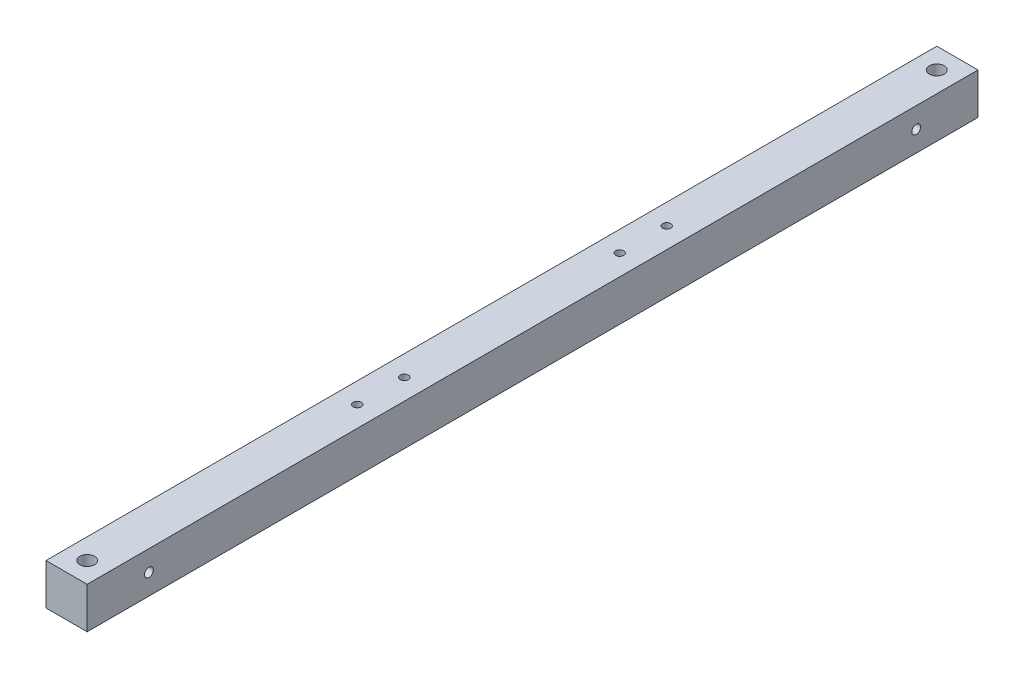
ISO-10303-21;
HEADER;
FILE_DESCRIPTION(('STEP AP214'),'2;1');
FILE_NAME('part.step','',(''),(''),'','','');
FILE_SCHEMA(('AUTOMOTIVE_DESIGN { 1 0 10303 214 1 1 1 1 }'));
ENDSEC;
DATA;
#1=APPLICATION_CONTEXT('core data for automotive mechanical design processes');
#2=APPLICATION_PROTOCOL_DEFINITION('international standard','automotive_design',2000,#1);
#3=PRODUCT_CONTEXT('',#1,'mechanical');
#4=PRODUCT('Part','Part','',(#3));
#5=PRODUCT_RELATED_PRODUCT_CATEGORY('part','',(#4));
#6=PRODUCT_DEFINITION_FORMATION('','',#4);
#7=PRODUCT_DEFINITION_CONTEXT('part definition',#1,'design');
#8=PRODUCT_DEFINITION('design','',#6,#7);
#9=PRODUCT_DEFINITION_SHAPE('','',#8);
#10=(LENGTH_UNIT() NAMED_UNIT(*) SI_UNIT(.MILLI.,.METRE.));
#11=(NAMED_UNIT(*) PLANE_ANGLE_UNIT() SI_UNIT($,.RADIAN.));
#12=(NAMED_UNIT(*) SI_UNIT($,.STERADIAN.) SOLID_ANGLE_UNIT());
#13=UNCERTAINTY_MEASURE_WITH_UNIT(LENGTH_MEASURE(1.E-05),#10,'distance_accuracy_value','');
#14=(GEOMETRIC_REPRESENTATION_CONTEXT(3) GLOBAL_UNCERTAINTY_ASSIGNED_CONTEXT((#13)) GLOBAL_UNIT_ASSIGNED_CONTEXT((#10,
#11,#12)) REPRESENTATION_CONTEXT('',''));
#15=CARTESIAN_POINT('',(0.,0.,0.));
#16=DIRECTION('',(0.,0.,1.));
#17=DIRECTION('',(1.,0.,0.));
#18=AXIS2_PLACEMENT_3D('',#15,#16,#17);
#19=CARTESIAN_POINT('',(0.,-14.,14.));
#20=DIRECTION('',(0.,1.,0.));
#21=DIRECTION('',(0.,0.,1.));
#22=AXIS2_PLACEMENT_3D('',#19,#20,#21);
#23=CYLINDRICAL_SURFACE('',#22,3.);
#24=CARTESIAN_POINT('',(0.,-14.,14.));
#25=DIRECTION('',(0.,1.,0.));
#26=DIRECTION('',(0.,0.,1.));
#27=AXIS2_PLACEMENT_3D('',#24,#25,#26);
#28=CIRCLE('',#27,3.);
#29=CARTESIAN_POINT('',(0.,-14.,17.));
#30=VERTEX_POINT('',#29);
#31=EDGE_CURVE('E121',#30,#30,#28,.T.);
#32=ORIENTED_EDGE('',*,*,#31,.F.);
#33=EDGE_LOOP('',(#32));
#34=FACE_BOUND('',#33,.T.);
#35=CARTESIAN_POINT('',(0.,7.,14.));
#36=DIRECTION('',(0.,1.,0.));
#37=DIRECTION('',(0.,0.,1.));
#38=AXIS2_PLACEMENT_3D('',#35,#36,#37);
#39=CIRCLE('',#38,3.);
#40=CARTESIAN_POINT('',(0.,7.,17.));
#41=VERTEX_POINT('',#40);
#42=EDGE_CURVE('E36',#41,#41,#39,.F.);
#43=ORIENTED_EDGE('',*,*,#42,.F.);
#44=EDGE_LOOP('',(#43));
#45=FACE_BOUND('',#44,.T.);
#46=ADVANCED_FACE('F32',(#34,#45),#23,.F.);
#47=CARTESIAN_POINT('',(0.,-14.,592.));
#48=DIRECTION('',(0.,1.,0.));
#49=DIRECTION('',(0.,0.,1.));
#50=AXIS2_PLACEMENT_3D('',#47,#48,#49);
#51=CYLINDRICAL_SURFACE('',#50,3.);
#52=CARTESIAN_POINT('',(0.,-14.,592.));
#53=DIRECTION('',(0.,1.,0.));
#54=DIRECTION('',(0.,0.,1.));
#55=AXIS2_PLACEMENT_3D('',#52,#53,#54);
#56=CIRCLE('',#55,3.);
#57=CARTESIAN_POINT('',(0.,-14.,595.));
#58=VERTEX_POINT('',#57);
#59=EDGE_CURVE('E140',#58,#58,#56,.T.);
#60=ORIENTED_EDGE('',*,*,#59,.F.);
#61=EDGE_LOOP('',(#60));
#62=FACE_BOUND('',#61,.T.);
#63=CARTESIAN_POINT('',(0.,7.,592.));
#64=DIRECTION('',(0.,1.,0.));
#65=DIRECTION('',(0.,0.,1.));
#66=AXIS2_PLACEMENT_3D('',#63,#64,#65);
#67=CIRCLE('',#66,3.);
#68=CARTESIAN_POINT('',(0.,7.,595.));
#69=VERTEX_POINT('',#68);
#70=EDGE_CURVE('E115',#69,#69,#67,.F.);
#71=ORIENTED_EDGE('',*,*,#70,.F.);
#72=EDGE_LOOP('',(#71));
#73=FACE_BOUND('',#72,.T.);
#74=ADVANCED_FACE('F185',(#62,#73),#51,.F.);
#75=CARTESIAN_POINT('',(-26.,0.,564.));
#76=DIRECTION('',(1.,0.,0.));
#77=DIRECTION('',(0.,0.,-1.));
#78=AXIS2_PLACEMENT_3D('',#75,#76,#77);
#79=CYLINDRICAL_SURFACE('',#78,3.00000000000005);
#80=CARTESIAN_POINT('',(14.,0.,564.));
#81=DIRECTION('',(1.,0.,0.));
#82=DIRECTION('',(0.,0.,-1.));
#83=AXIS2_PLACEMENT_3D('',#80,#81,#82);
#84=CIRCLE('',#83,3.00000000000005);
#85=CARTESIAN_POINT('',(14.,0.,561.));
#86=VERTEX_POINT('',#85);
#87=EDGE_CURVE('E114',#86,#86,#84,.T.);
#88=ORIENTED_EDGE('',*,*,#87,.T.);
#89=EDGE_LOOP('',(#88));
#90=FACE_BOUND('',#89,.T.);
#91=CARTESIAN_POINT('',(-7.,0.,564.));
#92=DIRECTION('',(-1.,0.,0.));
#93=DIRECTION('',(0.,0.,1.));
#94=AXIS2_PLACEMENT_3D('',#91,#92,#93);
#95=CIRCLE('',#94,3.00000000000005);
#96=CARTESIAN_POINT('',(-7.,0.,567.));
#97=VERTEX_POINT('',#96);
#98=EDGE_CURVE('E111',#97,#97,#95,.F.);
#99=ORIENTED_EDGE('',*,*,#98,.F.);
#100=EDGE_LOOP('',(#99));
#101=FACE_BOUND('',#100,.T.);
#102=ADVANCED_FACE('F161',(#90,#101),#79,.F.);
#103=CARTESIAN_POINT('',(-26.,0.,42.));
#104=DIRECTION('',(1.,0.,0.));
#105=DIRECTION('',(0.,0.,-1.));
#106=AXIS2_PLACEMENT_3D('',#103,#104,#105);
#107=CYLINDRICAL_SURFACE('',#106,3.);
#108=CARTESIAN_POINT('',(14.,0.,42.));
#109=DIRECTION('',(1.,0.,0.));
#110=DIRECTION('',(0.,0.,-1.));
#111=AXIS2_PLACEMENT_3D('',#108,#109,#110);
#112=CIRCLE('',#111,3.);
#113=CARTESIAN_POINT('',(14.,0.,39.));
#114=VERTEX_POINT('',#113);
#115=EDGE_CURVE('E102',#114,#114,#112,.T.);
#116=ORIENTED_EDGE('',*,*,#115,.T.);
#117=EDGE_LOOP('',(#116));
#118=FACE_BOUND('',#117,.T.);
#119=CARTESIAN_POINT('',(-7.,0.,42.));
#120=DIRECTION('',(-1.,0.,0.));
#121=DIRECTION('',(0.,0.,1.));
#122=AXIS2_PLACEMENT_3D('',#119,#120,#121);
#123=CIRCLE('',#122,3.);
#124=CARTESIAN_POINT('',(-7.,0.,45.));
#125=VERTEX_POINT('',#124);
#126=EDGE_CURVE('E108',#125,#125,#123,.F.);
#127=ORIENTED_EDGE('',*,*,#126,.F.);
#128=EDGE_LOOP('',(#127));
#129=FACE_BOUND('',#128,.T.);
#130=ADVANCED_FACE('F166',(#118,#129),#107,.F.);
#131=CARTESIAN_POINT('',(14.,-14.,606.));
#132=DIRECTION('',(-1.,0.,0.));
#133=DIRECTION('',(0.,0.,1.));
#134=AXIS2_PLACEMENT_3D('',#131,#132,#133);
#135=PLANE('',#134);
#136=ORIENTED_EDGE('',*,*,#115,.F.);
#137=EDGE_LOOP('',(#136));
#138=FACE_BOUND('',#137,.T.);
#139=ORIENTED_EDGE('',*,*,#87,.F.);
#140=EDGE_LOOP('',(#139));
#141=FACE_BOUND('',#140,.T.);
#142=DIRECTION('',(0.,1.,0.));
#143=VECTOR('',#142,1.);
#144=CARTESIAN_POINT('',(14.,-14.,0.));
#145=LINE('',#144,#143);
#146=CARTESIAN_POINT('',(14.,-14.,0.));
#147=VERTEX_POINT('',#146);
#148=CARTESIAN_POINT('',(14.,14.,0.));
#149=VERTEX_POINT('',#148);
#150=EDGE_CURVE('E99',#147,#149,#145,.T.);
#151=ORIENTED_EDGE('',*,*,#150,.T.);
#152=DIRECTION('',(0.,0.,-1.));
#153=VECTOR('',#152,1.);
#154=CARTESIAN_POINT('',(14.,14.,606.));
#155=LINE('',#154,#153);
#156=CARTESIAN_POINT('',(14.,14.,606.));
#157=VERTEX_POINT('',#156);
#158=EDGE_CURVE('E11',#157,#149,#155,.T.);
#159=ORIENTED_EDGE('',*,*,#158,.F.);
#160=DIRECTION('',(0.,1.,0.));
#161=VECTOR('',#160,1.);
#162=CARTESIAN_POINT('',(14.,-14.,606.));
#163=LINE('',#162,#161);
#164=CARTESIAN_POINT('',(14.,-14.,606.));
#165=VERTEX_POINT('',#164);
#166=EDGE_CURVE('E86',#165,#157,#163,.T.);
#167=ORIENTED_EDGE('',*,*,#166,.F.);
#168=DIRECTION('',(0.,0.,-1.));
#169=VECTOR('',#168,1.);
#170=CARTESIAN_POINT('',(14.,-14.,606.));
#171=LINE('',#170,#169);
#172=EDGE_CURVE('E95',#165,#147,#171,.T.);
#173=ORIENTED_EDGE('',*,*,#172,.T.);
#174=EDGE_LOOP('',(#151,#159,#167,#173));
#175=FACE_BOUND('',#174,.T.);
#176=ADVANCED_FACE('F34',(#138,#141,#175),#135,.F.);
#177=CARTESIAN_POINT('',(-14.,14.,606.));
#178=DIRECTION('',(0.,-1.,0.));
#179=DIRECTION('',(0.,0.,-1.));
#180=AXIS2_PLACEMENT_3D('',#177,#178,#179);
#181=PLANE('',#180);
#182=CARTESIAN_POINT('',(0.,14.,408.25));
#183=DIRECTION('',(0.,1.,0.));
#184=DIRECTION('',(0.,0.,1.));
#185=AXIS2_PLACEMENT_3D('',#182,#183,#184);
#186=CIRCLE('',#185,2.75);
#187=CARTESIAN_POINT('',(0.,14.,411.));
#188=VERTEX_POINT('',#187);
#189=EDGE_CURVE('E378',#188,#188,#186,.T.);
#190=ORIENTED_EDGE('',*,*,#189,.F.);
#191=EDGE_LOOP('',(#190));
#192=FACE_BOUND('',#191,.T.);
#193=CARTESIAN_POINT('',(0.,14.,376.25));
#194=DIRECTION('',(0.,1.,0.));
#195=DIRECTION('',(0.,0.,1.));
#196=AXIS2_PLACEMENT_3D('',#193,#194,#195);
#197=CIRCLE('',#196,2.75);
#198=CARTESIAN_POINT('',(0.,14.,379.));
#199=VERTEX_POINT('',#198);
#200=EDGE_CURVE('E382',#199,#199,#197,.T.);
#201=ORIENTED_EDGE('',*,*,#200,.F.);
#202=EDGE_LOOP('',(#201));
#203=FACE_BOUND('',#202,.T.);
#204=CARTESIAN_POINT('',(0.,14.,229.75));
#205=DIRECTION('',(0.,1.,0.));
#206=DIRECTION('',(0.,0.,-1.));
#207=AXIS2_PLACEMENT_3D('',#204,#205,#206);
#208=CIRCLE('',#207,2.75);
#209=CARTESIAN_POINT('',(0.,14.,227.));
#210=VERTEX_POINT('',#209);
#211=EDGE_CURVE('E386',#210,#210,#208,.T.);
#212=ORIENTED_EDGE('',*,*,#211,.F.);
#213=EDGE_LOOP('',(#212));
#214=FACE_BOUND('',#213,.T.);
#215=CARTESIAN_POINT('',(0.,14.,197.75));
#216=DIRECTION('',(0.,1.,0.));
#217=DIRECTION('',(0.,0.,-1.));
#218=AXIS2_PLACEMENT_3D('',#215,#216,#217);
#219=CIRCLE('',#218,2.75);
#220=CARTESIAN_POINT('',(0.,14.,195.));
#221=VERTEX_POINT('',#220);
#222=EDGE_CURVE('E131',#221,#221,#219,.T.);
#223=ORIENTED_EDGE('',*,*,#222,.F.);
#224=EDGE_LOOP('',(#223));
#225=FACE_BOUND('',#224,.T.);
#226=CARTESIAN_POINT('',(0.,14.,14.));
#227=DIRECTION('',(0.,1.,0.));
#228=DIRECTION('',(0.,0.,1.));
#229=AXIS2_PLACEMENT_3D('',#226,#227,#228);
#230=CIRCLE('',#229,5.);
#231=CARTESIAN_POINT('',(0.,14.,19.));
#232=VERTEX_POINT('',#231);
#233=EDGE_CURVE('E123',#232,#232,#230,.T.);
#234=ORIENTED_EDGE('',*,*,#233,.F.);
#235=EDGE_LOOP('',(#234));
#236=FACE_BOUND('',#235,.T.);
#237=CARTESIAN_POINT('',(0.,14.,592.));
#238=DIRECTION('',(0.,1.,0.));
#239=DIRECTION('',(0.,0.,1.));
#240=AXIS2_PLACEMENT_3D('',#237,#238,#239);
#241=CIRCLE('',#240,5.);
#242=CARTESIAN_POINT('',(0.,14.,597.));
#243=VERTEX_POINT('',#242);
#244=EDGE_CURVE('E136',#243,#243,#241,.T.);
#245=ORIENTED_EDGE('',*,*,#244,.F.);
#246=EDGE_LOOP('',(#245));
#247=FACE_BOUND('',#246,.T.);
#248=DIRECTION('',(-1.,0.,0.));
#249=VECTOR('',#248,1.);
#250=CARTESIAN_POINT('',(-14.,14.,0.));
#251=LINE('',#250,#249);
#252=CARTESIAN_POINT('',(-14.,14.,0.));
#253=VERTEX_POINT('',#252);
#254=EDGE_CURVE('E90',#149,#253,#251,.T.);
#255=ORIENTED_EDGE('',*,*,#254,.T.);
#256=DIRECTION('',(0.,0.,-1.));
#257=VECTOR('',#256,1.);
#258=CARTESIAN_POINT('',(-14.,14.,606.));
#259=LINE('',#258,#257);
#260=CARTESIAN_POINT('',(-14.,14.,606.));
#261=VERTEX_POINT('',#260);
#262=EDGE_CURVE('E42',#261,#253,#259,.T.);
#263=ORIENTED_EDGE('',*,*,#262,.F.);
#264=DIRECTION('',(-1.,0.,0.));
#265=VECTOR('',#264,1.);
#266=CARTESIAN_POINT('',(-14.,14.,606.));
#267=LINE('',#266,#265);
#268=EDGE_CURVE('E81',#157,#261,#267,.T.);
#269=ORIENTED_EDGE('',*,*,#268,.F.);
#270=ORIENTED_EDGE('',*,*,#158,.T.);
#271=EDGE_LOOP('',(#255,#263,#269,#270));
#272=FACE_BOUND('',#271,.T.);
#273=ADVANCED_FACE('F89',(#192,#203,#214,#225,#236,#247,#272),#181,.F.);
#274=CARTESIAN_POINT('',(-14.,-14.,606.));
#275=DIRECTION('',(1.,0.,0.));
#276=DIRECTION('',(0.,0.,-1.));
#277=AXIS2_PLACEMENT_3D('',#274,#275,#276);
#278=PLANE('',#277);
#279=CARTESIAN_POINT('',(-14.,0.,42.));
#280=DIRECTION('',(-1.,0.,0.));
#281=DIRECTION('',(0.,0.,1.));
#282=AXIS2_PLACEMENT_3D('',#279,#280,#281);
#283=CIRCLE('',#282,5.);
#284=CARTESIAN_POINT('',(-14.,0.,47.));
#285=VERTEX_POINT('',#284);
#286=EDGE_CURVE('E148',#285,#285,#283,.T.);
#287=ORIENTED_EDGE('',*,*,#286,.F.);
#288=EDGE_LOOP('',(#287));
#289=FACE_BOUND('',#288,.T.);
#290=CARTESIAN_POINT('',(-14.,0.,564.));
#291=DIRECTION('',(-1.,0.,0.));
#292=DIRECTION('',(0.,0.,1.));
#293=AXIS2_PLACEMENT_3D('',#290,#291,#292);
#294=CIRCLE('',#293,5.00000000000004);
#295=CARTESIAN_POINT('',(-14.,0.,569.));
#296=VERTEX_POINT('',#295);
#297=EDGE_CURVE('E143',#296,#296,#294,.T.);
#298=ORIENTED_EDGE('',*,*,#297,.F.);
#299=EDGE_LOOP('',(#298));
#300=FACE_BOUND('',#299,.T.);
#301=DIRECTION('',(0.,-1.,0.));
#302=VECTOR('',#301,1.);
#303=CARTESIAN_POINT('',(-14.,-14.,0.));
#304=LINE('',#303,#302);
#305=CARTESIAN_POINT('',(-14.,-14.,0.));
#306=VERTEX_POINT('',#305);
#307=EDGE_CURVE('E68',#253,#306,#304,.T.);
#308=ORIENTED_EDGE('',*,*,#307,.T.);
#309=DIRECTION('',(0.,0.,-1.));
#310=VECTOR('',#309,1.);
#311=CARTESIAN_POINT('',(-14.,-14.,606.));
#312=LINE('',#311,#310);
#313=CARTESIAN_POINT('',(-14.,-14.,606.));
#314=VERTEX_POINT('',#313);
#315=EDGE_CURVE('E91',#314,#306,#312,.T.);
#316=ORIENTED_EDGE('',*,*,#315,.F.);
#317=DIRECTION('',(0.,-1.,0.));
#318=VECTOR('',#317,1.);
#319=CARTESIAN_POINT('',(-14.,-14.,606.));
#320=LINE('',#319,#318);
#321=EDGE_CURVE('E84',#261,#314,#320,.T.);
#322=ORIENTED_EDGE('',*,*,#321,.F.);
#323=ORIENTED_EDGE('',*,*,#262,.T.);
#324=EDGE_LOOP('',(#308,#316,#322,#323));
#325=FACE_BOUND('',#324,.T.);
#326=ADVANCED_FACE('F93',(#289,#300,#325),#278,.F.);
#327=CARTESIAN_POINT('',(-14.,-14.,606.));
#328=DIRECTION('',(0.,1.,0.));
#329=DIRECTION('',(0.,0.,1.));
#330=AXIS2_PLACEMENT_3D('',#327,#328,#329);
#331=PLANE('',#330);
#332=CARTESIAN_POINT('',(0.,-14.,408.25));
#333=DIRECTION('',(0.,1.,0.));
#334=DIRECTION('',(0.,0.,1.));
#335=AXIS2_PLACEMENT_3D('',#332,#333,#334);
#336=CIRCLE('',#335,2.75);
#337=CARTESIAN_POINT('',(0.,-14.,411.));
#338=VERTEX_POINT('',#337);
#339=EDGE_CURVE('E139',#338,#338,#336,.T.);
#340=ORIENTED_EDGE('',*,*,#339,.T.);
#341=EDGE_LOOP('',(#340));
#342=FACE_BOUND('',#341,.T.);
#343=CARTESIAN_POINT('',(0.,-14.,376.25));
#344=DIRECTION('',(0.,1.,0.));
#345=DIRECTION('',(0.,0.,1.));
#346=AXIS2_PLACEMENT_3D('',#343,#344,#345);
#347=CIRCLE('',#346,2.75);
#348=CARTESIAN_POINT('',(0.,-14.,379.));
#349=VERTEX_POINT('',#348);
#350=EDGE_CURVE('E406',#349,#349,#347,.T.);
#351=ORIENTED_EDGE('',*,*,#350,.T.);
#352=EDGE_LOOP('',(#351));
#353=FACE_BOUND('',#352,.T.);
#354=CARTESIAN_POINT('',(0.,-14.,229.75));
#355=DIRECTION('',(0.,1.,0.));
#356=DIRECTION('',(0.,0.,-1.));
#357=AXIS2_PLACEMENT_3D('',#354,#355,#356);
#358=CIRCLE('',#357,2.75);
#359=CARTESIAN_POINT('',(0.,-14.,227.));
#360=VERTEX_POINT('',#359);
#361=EDGE_CURVE('E400',#360,#360,#358,.T.);
#362=ORIENTED_EDGE('',*,*,#361,.T.);
#363=EDGE_LOOP('',(#362));
#364=FACE_BOUND('',#363,.T.);
#365=CARTESIAN_POINT('',(0.,-14.,197.75));
#366=DIRECTION('',(0.,1.,0.));
#367=DIRECTION('',(0.,0.,-1.));
#368=AXIS2_PLACEMENT_3D('',#365,#366,#367);
#369=CIRCLE('',#368,2.75);
#370=CARTESIAN_POINT('',(0.,-14.,195.));
#371=VERTEX_POINT('',#370);
#372=EDGE_CURVE('E396',#371,#371,#369,.T.);
#373=ORIENTED_EDGE('',*,*,#372,.T.);
#374=EDGE_LOOP('',(#373));
#375=FACE_BOUND('',#374,.T.);
#376=ORIENTED_EDGE('',*,*,#59,.T.);
#377=EDGE_LOOP('',(#376));
#378=FACE_BOUND('',#377,.T.);
#379=ORIENTED_EDGE('',*,*,#31,.T.);
#380=EDGE_LOOP('',(#379));
#381=FACE_BOUND('',#380,.T.);
#382=DIRECTION('',(1.,0.,0.));
#383=VECTOR('',#382,1.);
#384=CARTESIAN_POINT('',(-14.,-14.,0.));
#385=LINE('',#384,#383);
#386=EDGE_CURVE('E74',#306,#147,#385,.T.);
#387=ORIENTED_EDGE('',*,*,#386,.T.);
#388=ORIENTED_EDGE('',*,*,#172,.F.);
#389=DIRECTION('',(1.,0.,0.));
#390=VECTOR('',#389,1.);
#391=CARTESIAN_POINT('',(-14.,-14.,606.));
#392=LINE('',#391,#390);
#393=EDGE_CURVE('E51',#314,#165,#392,.T.);
#394=ORIENTED_EDGE('',*,*,#393,.F.);
#395=ORIENTED_EDGE('',*,*,#315,.T.);
#396=EDGE_LOOP('',(#387,#388,#394,#395));
#397=FACE_BOUND('',#396,.T.);
#398=ADVANCED_FACE('F182',(#342,#353,#364,#375,#378,#381,#397),#331,.F.);
#399=CARTESIAN_POINT('',(0.,0.,606.));
#400=DIRECTION('',(0.,0.,-1.));
#401=DIRECTION('',(-1.,0.,0.));
#402=AXIS2_PLACEMENT_3D('',#399,#400,#401);
#403=PLANE('',#402);
#404=ORIENTED_EDGE('',*,*,#166,.T.);
#405=ORIENTED_EDGE('',*,*,#268,.T.);
#406=ORIENTED_EDGE('',*,*,#321,.T.);
#407=ORIENTED_EDGE('',*,*,#393,.T.);
#408=EDGE_LOOP('',(#404,#405,#406,#407));
#409=FACE_BOUND('',#408,.T.);
#410=ADVANCED_FACE('F82',(#409),#403,.F.);
#411=CARTESIAN_POINT('',(0.,0.,0.));
#412=DIRECTION('',(0.,0.,-1.));
#413=DIRECTION('',(-1.,0.,0.));
#414=AXIS2_PLACEMENT_3D('',#411,#412,#413);
#415=PLANE('',#414);
#416=ORIENTED_EDGE('',*,*,#150,.F.);
#417=ORIENTED_EDGE('',*,*,#386,.F.);
#418=ORIENTED_EDGE('',*,*,#307,.F.);
#419=ORIENTED_EDGE('',*,*,#254,.F.);
#420=EDGE_LOOP('',(#416,#417,#418,#419));
#421=FACE_BOUND('',#420,.T.);
#422=ADVANCED_FACE('F170',(#421),#415,.T.);
#423=CARTESIAN_POINT('',(-7.,0.,42.));
#424=DIRECTION('',(-1.,0.,0.));
#425=DIRECTION('',(0.,0.,1.));
#426=AXIS2_PLACEMENT_3D('',#423,#424,#425);
#427=PLANE('',#426);
#428=CARTESIAN_POINT('',(-7.,0.,42.));
#429=DIRECTION('',(-1.,0.,0.));
#430=DIRECTION('',(0.,0.,1.));
#431=AXIS2_PLACEMENT_3D('',#428,#429,#430);
#432=CIRCLE('',#431,5.);
#433=CARTESIAN_POINT('',(-7.,0.,47.));
#434=VERTEX_POINT('',#433);
#435=EDGE_CURVE('E112',#434,#434,#432,.T.);
#436=ORIENTED_EDGE('',*,*,#435,.T.);
#437=EDGE_LOOP('',(#436));
#438=FACE_BOUND('',#437,.T.);
#439=ORIENTED_EDGE('',*,*,#126,.T.);
#440=EDGE_LOOP('',(#439));
#441=FACE_BOUND('',#440,.T.);
#442=ADVANCED_FACE('F172',(#438,#441),#427,.T.);
#443=CARTESIAN_POINT('',(-7.,0.,42.));
#444=DIRECTION('',(-1.,0.,0.));
#445=DIRECTION('',(0.,0.,1.));
#446=AXIS2_PLACEMENT_3D('',#443,#444,#445);
#447=CYLINDRICAL_SURFACE('',#446,5.);
#448=ORIENTED_EDGE('',*,*,#435,.F.);
#449=EDGE_LOOP('',(#448));
#450=FACE_BOUND('',#449,.T.);
#451=ORIENTED_EDGE('',*,*,#286,.T.);
#452=EDGE_LOOP('',(#451));
#453=FACE_BOUND('',#452,.T.);
#454=ADVANCED_FACE('F179',(#450,#453),#447,.F.);
#455=CARTESIAN_POINT('',(-7.,0.,564.));
#456=DIRECTION('',(-1.,0.,0.));
#457=DIRECTION('',(0.,0.,1.));
#458=AXIS2_PLACEMENT_3D('',#455,#456,#457);
#459=PLANE('',#458);
#460=CARTESIAN_POINT('',(-7.,0.,564.));
#461=DIRECTION('',(-1.,0.,0.));
#462=DIRECTION('',(0.,0.,1.));
#463=AXIS2_PLACEMENT_3D('',#460,#461,#462);
#464=CIRCLE('',#463,5.00000000000004);
#465=CARTESIAN_POINT('',(-7.,0.,569.));
#466=VERTEX_POINT('',#465);
#467=EDGE_CURVE('E151',#466,#466,#464,.T.);
#468=ORIENTED_EDGE('',*,*,#467,.T.);
#469=EDGE_LOOP('',(#468));
#470=FACE_BOUND('',#469,.T.);
#471=ORIENTED_EDGE('',*,*,#98,.T.);
#472=EDGE_LOOP('',(#471));
#473=FACE_BOUND('',#472,.T.);
#474=ADVANCED_FACE('F199',(#470,#473),#459,.T.);
#475=CARTESIAN_POINT('',(-7.,0.,564.));
#476=DIRECTION('',(-1.,0.,0.));
#477=DIRECTION('',(0.,0.,1.));
#478=AXIS2_PLACEMENT_3D('',#475,#476,#477);
#479=CYLINDRICAL_SURFACE('',#478,5.00000000000004);
#480=ORIENTED_EDGE('',*,*,#467,.F.);
#481=EDGE_LOOP('',(#480));
#482=FACE_BOUND('',#481,.T.);
#483=ORIENTED_EDGE('',*,*,#297,.T.);
#484=EDGE_LOOP('',(#483));
#485=FACE_BOUND('',#484,.T.);
#486=ADVANCED_FACE('F203',(#482,#485),#479,.F.);
#487=CARTESIAN_POINT('',(0.,7.,592.));
#488=DIRECTION('',(0.,1.,0.));
#489=DIRECTION('',(0.,0.,1.));
#490=AXIS2_PLACEMENT_3D('',#487,#488,#489);
#491=PLANE('',#490);
#492=CARTESIAN_POINT('',(0.,7.,592.));
#493=DIRECTION('',(0.,1.,0.));
#494=DIRECTION('',(0.,0.,1.));
#495=AXIS2_PLACEMENT_3D('',#492,#493,#494);
#496=CIRCLE('',#495,5.);
#497=CARTESIAN_POINT('',(0.,7.,597.));
#498=VERTEX_POINT('',#497);
#499=EDGE_CURVE('E128',#498,#498,#496,.T.);
#500=ORIENTED_EDGE('',*,*,#499,.T.);
#501=EDGE_LOOP('',(#500));
#502=FACE_BOUND('',#501,.T.);
#503=ORIENTED_EDGE('',*,*,#70,.T.);
#504=EDGE_LOOP('',(#503));
#505=FACE_BOUND('',#504,.T.);
#506=ADVANCED_FACE('F207',(#502,#505),#491,.T.);
#507=CARTESIAN_POINT('',(0.,7.,592.));
#508=DIRECTION('',(0.,1.,0.));
#509=DIRECTION('',(0.,0.,1.));
#510=AXIS2_PLACEMENT_3D('',#507,#508,#509);
#511=CYLINDRICAL_SURFACE('',#510,5.);
#512=ORIENTED_EDGE('',*,*,#499,.F.);
#513=EDGE_LOOP('',(#512));
#514=FACE_BOUND('',#513,.T.);
#515=ORIENTED_EDGE('',*,*,#244,.T.);
#516=EDGE_LOOP('',(#515));
#517=FACE_BOUND('',#516,.T.);
#518=ADVANCED_FACE('F244',(#514,#517),#511,.F.);
#519=CARTESIAN_POINT('',(0.,7.,14.));
#520=DIRECTION('',(0.,1.,0.));
#521=DIRECTION('',(0.,0.,1.));
#522=AXIS2_PLACEMENT_3D('',#519,#520,#521);
#523=PLANE('',#522);
#524=CARTESIAN_POINT('',(0.,7.,14.));
#525=DIRECTION('',(0.,1.,0.));
#526=DIRECTION('',(0.,0.,1.));
#527=AXIS2_PLACEMENT_3D('',#524,#525,#526);
#528=CIRCLE('',#527,5.);
#529=CARTESIAN_POINT('',(0.,7.,19.));
#530=VERTEX_POINT('',#529);
#531=EDGE_CURVE('E117',#530,#530,#528,.T.);
#532=ORIENTED_EDGE('',*,*,#531,.T.);
#533=EDGE_LOOP('',(#532));
#534=FACE_BOUND('',#533,.T.);
#535=ORIENTED_EDGE('',*,*,#42,.T.);
#536=EDGE_LOOP('',(#535));
#537=FACE_BOUND('',#536,.T.);
#538=ADVANCED_FACE('F252',(#534,#537),#523,.T.);
#539=CARTESIAN_POINT('',(0.,7.,14.));
#540=DIRECTION('',(0.,1.,0.));
#541=DIRECTION('',(0.,0.,1.));
#542=AXIS2_PLACEMENT_3D('',#539,#540,#541);
#543=CYLINDRICAL_SURFACE('',#542,5.);
#544=ORIENTED_EDGE('',*,*,#531,.F.);
#545=EDGE_LOOP('',(#544));
#546=FACE_BOUND('',#545,.T.);
#547=ORIENTED_EDGE('',*,*,#233,.T.);
#548=EDGE_LOOP('',(#547));
#549=FACE_BOUND('',#548,.T.);
#550=ADVANCED_FACE('F259',(#546,#549),#543,.F.);
#551=CARTESIAN_POINT('',(0.,-14.,197.75));
#552=DIRECTION('',(0.,1.,0.));
#553=DIRECTION('',(0.,0.,1.));
#554=AXIS2_PLACEMENT_3D('',#551,#552,#553);
#555=CYLINDRICAL_SURFACE('',#554,2.75);
#556=ORIENTED_EDGE('',*,*,#372,.F.);
#557=EDGE_LOOP('',(#556));
#558=FACE_BOUND('',#557,.T.);
#559=ORIENTED_EDGE('',*,*,#222,.T.);
#560=EDGE_LOOP('',(#559));
#561=FACE_BOUND('',#560,.T.);
#562=ADVANCED_FACE('F266',(#558,#561),#555,.F.);
#563=CARTESIAN_POINT('',(0.,-14.,229.75));
#564=DIRECTION('',(0.,1.,0.));
#565=DIRECTION('',(0.,0.,1.));
#566=AXIS2_PLACEMENT_3D('',#563,#564,#565);
#567=CYLINDRICAL_SURFACE('',#566,2.75);
#568=ORIENTED_EDGE('',*,*,#361,.F.);
#569=EDGE_LOOP('',(#568));
#570=FACE_BOUND('',#569,.T.);
#571=ORIENTED_EDGE('',*,*,#211,.T.);
#572=EDGE_LOOP('',(#571));
#573=FACE_BOUND('',#572,.T.);
#574=ADVANCED_FACE('F275',(#570,#573),#567,.F.);
#575=CARTESIAN_POINT('',(0.,-14.,376.25));
#576=DIRECTION('',(0.,1.,0.));
#577=DIRECTION('',(0.,0.,1.));
#578=AXIS2_PLACEMENT_3D('',#575,#576,#577);
#579=CYLINDRICAL_SURFACE('',#578,2.75);
#580=ORIENTED_EDGE('',*,*,#350,.F.);
#581=EDGE_LOOP('',(#580));
#582=FACE_BOUND('',#581,.T.);
#583=ORIENTED_EDGE('',*,*,#200,.T.);
#584=EDGE_LOOP('',(#583));
#585=FACE_BOUND('',#584,.T.);
#586=ADVANCED_FACE('F284',(#582,#585),#579,.F.);
#587=CARTESIAN_POINT('',(0.,-14.,408.25));
#588=DIRECTION('',(0.,1.,0.));
#589=DIRECTION('',(0.,0.,1.));
#590=AXIS2_PLACEMENT_3D('',#587,#588,#589);
#591=CYLINDRICAL_SURFACE('',#590,2.75);
#592=ORIENTED_EDGE('',*,*,#339,.F.);
#593=EDGE_LOOP('',(#592));
#594=FACE_BOUND('',#593,.T.);
#595=ORIENTED_EDGE('',*,*,#189,.T.);
#596=EDGE_LOOP('',(#595));
#597=FACE_BOUND('',#596,.T.);
#598=ADVANCED_FACE('F292',(#594,#597),#591,.F.);
#599=CLOSED_SHELL('',(#46,#74,#102,#130,#176,#273,#326,#398,#410,#422,#442,#454,#474,#486,#506,
#518,#538,#550,#562,#574,#586,#598));
#600=MANIFOLD_SOLID_BREP('B2',#599);
#601=ADVANCED_BREP_SHAPE_REPRESENTATION('',(#18,#600),#14);
#602=SHAPE_DEFINITION_REPRESENTATION(#9,#601);
ENDSEC;
END-ISO-10303-21;
